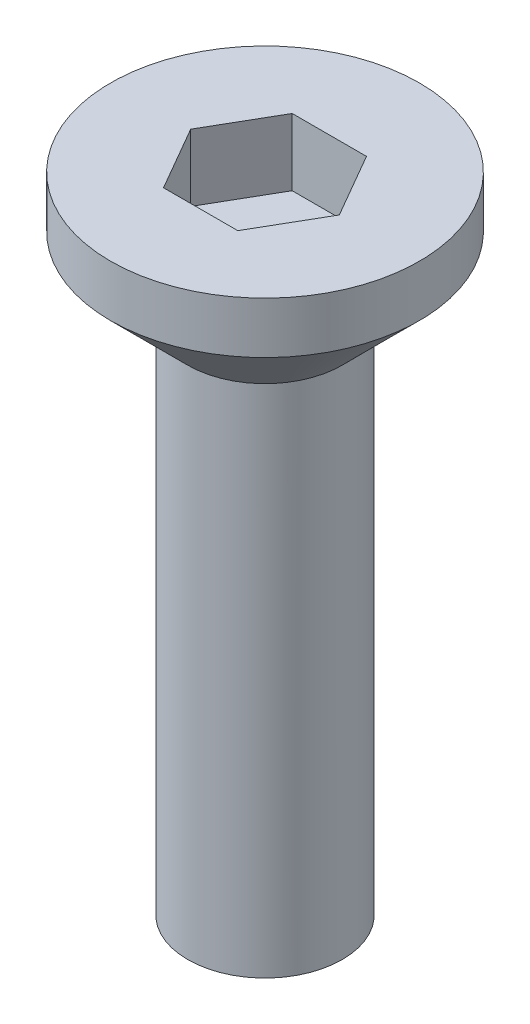
ISO-10303-21;
HEADER;
FILE_DESCRIPTION(('STEP AP214'),'2;1');
FILE_NAME('part.step','',(''),(''),'','','');
FILE_SCHEMA(('AUTOMOTIVE_DESIGN { 1 0 10303 214 1 1 1 1 }'));
ENDSEC;
DATA;
#1=APPLICATION_CONTEXT('core data for automotive mechanical design processes');
#2=APPLICATION_PROTOCOL_DEFINITION('international standard','automotive_design',2000,#1);
#3=PRODUCT_CONTEXT('',#1,'mechanical');
#4=PRODUCT('Part','Part','',(#3));
#5=PRODUCT_RELATED_PRODUCT_CATEGORY('part','',(#4));
#6=PRODUCT_DEFINITION_FORMATION('','',#4);
#7=PRODUCT_DEFINITION_CONTEXT('part definition',#1,'design');
#8=PRODUCT_DEFINITION('design','',#6,#7);
#9=PRODUCT_DEFINITION_SHAPE('','',#8);
#10=(LENGTH_UNIT() NAMED_UNIT(*) SI_UNIT(.MILLI.,.METRE.));
#11=(NAMED_UNIT(*) PLANE_ANGLE_UNIT() SI_UNIT($,.RADIAN.));
#12=(NAMED_UNIT(*) SI_UNIT($,.STERADIAN.) SOLID_ANGLE_UNIT());
#13=UNCERTAINTY_MEASURE_WITH_UNIT(LENGTH_MEASURE(1.E-05),#10,'distance_accuracy_value','');
#14=(GEOMETRIC_REPRESENTATION_CONTEXT(3) GLOBAL_UNCERTAINTY_ASSIGNED_CONTEXT((#13)) GLOBAL_UNIT_ASSIGNED_CONTEXT((#10,
#11,#12)) REPRESENTATION_CONTEXT('',''));
#15=CARTESIAN_POINT('',(0.,0.,0.));
#16=DIRECTION('',(0.,0.,1.));
#17=DIRECTION('',(1.,0.,0.));
#18=AXIS2_PLACEMENT_3D('',#15,#16,#17);
#19=CARTESIAN_POINT('',(0.,2.5,0.));
#20=DIRECTION('',(0.,-1.,0.));
#21=DIRECTION('',(0.,0.,-1.));
#22=AXIS2_PLACEMENT_3D('',#19,#20,#21);
#23=CYLINDRICAL_SURFACE('',#22,3.);
#24=CARTESIAN_POINT('',(0.,1.5,0.));
#25=DIRECTION('',(0.,1.,0.));
#26=DIRECTION('',(0.,0.,1.));
#27=AXIS2_PLACEMENT_3D('',#24,#25,#26);
#28=CIRCLE('',#27,3.);
#29=CARTESIAN_POINT('',(0.,1.5,3.));
#30=VERTEX_POINT('',#29);
#31=EDGE_CURVE('E45',#30,#30,#28,.T.);
#32=ORIENTED_EDGE('',*,*,#31,.T.);
#33=EDGE_LOOP('',(#32));
#34=FACE_BOUND('',#33,.T.);
#35=CARTESIAN_POINT('',(0.,2.5,0.));
#36=DIRECTION('',(0.,1.,0.));
#37=DIRECTION('',(0.,0.,1.));
#38=AXIS2_PLACEMENT_3D('',#35,#36,#37);
#39=CIRCLE('',#38,3.);
#40=CARTESIAN_POINT('',(0.,2.5,3.));
#41=VERTEX_POINT('',#40);
#42=EDGE_CURVE('E140',#41,#41,#39,.T.);
#43=ORIENTED_EDGE('',*,*,#42,.F.);
#44=EDGE_LOOP('',(#43));
#45=FACE_BOUND('',#44,.T.);
#46=ADVANCED_FACE('F37',(#34,#45),#23,.T.);
#47=CARTESIAN_POINT('',(0.,2.5,0.));
#48=DIRECTION('',(0.,1.,0.));
#49=DIRECTION('',(0.,0.,1.));
#50=AXIS2_PLACEMENT_3D('',#47,#48,#49);
#51=PLANE('',#50);
#52=DIRECTION('',(0.5,0.,-0.866025403784439));
#53=VECTOR('',#52,1.);
#54=CARTESIAN_POINT('',(0.721687836487032,2.5,1.25));
#55=LINE('',#54,#53);
#56=CARTESIAN_POINT('',(0.721687836487032,2.5,1.25));
#57=VERTEX_POINT('',#56);
#58=CARTESIAN_POINT('',(1.44337567297406,2.5,0.));
#59=VERTEX_POINT('',#58);
#60=EDGE_CURVE('E52',#57,#59,#55,.T.);
#61=ORIENTED_EDGE('',*,*,#60,.F.);
#62=DIRECTION('',(1.,0.,0.));
#63=VECTOR('',#62,1.);
#64=CARTESIAN_POINT('',(-0.721687836487033,2.5,1.25));
#65=LINE('',#64,#63);
#66=CARTESIAN_POINT('',(-0.721687836487033,2.5,1.25));
#67=VERTEX_POINT('',#66);
#68=EDGE_CURVE('E136',#67,#57,#65,.T.);
#69=ORIENTED_EDGE('',*,*,#68,.F.);
#70=DIRECTION('',(0.5,0.,0.866025403784439));
#71=VECTOR('',#70,1.);
#72=CARTESIAN_POINT('',(-1.44337567297407,2.5,0.));
#73=LINE('',#72,#71);
#74=CARTESIAN_POINT('',(-1.44337567297407,2.5,0.));
#75=VERTEX_POINT('',#74);
#76=EDGE_CURVE('E134',#75,#67,#73,.T.);
#77=ORIENTED_EDGE('',*,*,#76,.F.);
#78=DIRECTION('',(-0.5,0.,0.866025403784438));
#79=VECTOR('',#78,1.);
#80=CARTESIAN_POINT('',(-0.721687836487033,2.5,-1.25));
#81=LINE('',#80,#79);
#82=CARTESIAN_POINT('',(-0.721687836487033,2.5,-1.25));
#83=VERTEX_POINT('',#82);
#84=EDGE_CURVE('E100',#83,#75,#81,.T.);
#85=ORIENTED_EDGE('',*,*,#84,.F.);
#86=DIRECTION('',(-1.,0.,0.));
#87=VECTOR('',#86,1.);
#88=CARTESIAN_POINT('',(0.721687836487032,2.5,-1.25));
#89=LINE('',#88,#87);
#90=CARTESIAN_POINT('',(0.721687836487032,2.5,-1.25));
#91=VERTEX_POINT('',#90);
#92=EDGE_CURVE('E130',#91,#83,#89,.T.);
#93=ORIENTED_EDGE('',*,*,#92,.F.);
#94=DIRECTION('',(-0.5,0.,-0.866025403784439));
#95=VECTOR('',#94,1.);
#96=CARTESIAN_POINT('',(1.44337567297406,2.5,0.));
#97=LINE('',#96,#95);
#98=EDGE_CURVE('E126',#59,#91,#97,.T.);
#99=ORIENTED_EDGE('',*,*,#98,.F.);
#100=EDGE_LOOP('',(#61,#69,#77,#85,#93,#99));
#101=FACE_BOUND('',#100,.T.);
#102=ORIENTED_EDGE('',*,*,#42,.T.);
#103=EDGE_LOOP('',(#102));
#104=FACE_BOUND('',#103,.T.);
#105=ADVANCED_FACE('F154',(#101,#104),#51,.T.);
#106=CARTESIAN_POINT('',(0.,1.5,0.));
#107=DIRECTION('',(0.,1.,0.));
#108=DIRECTION('',(0.,0.,1.));
#109=AXIS2_PLACEMENT_3D('',#106,#107,#108);
#110=CONICAL_SURFACE('',#109,3.,0.78539816339745);
#111=CARTESIAN_POINT('',(0.,0.,0.));
#112=DIRECTION('',(0.,1.,0.));
#113=DIRECTION('',(0.,0.,1.));
#114=AXIS2_PLACEMENT_3D('',#111,#112,#113);
#115=CIRCLE('',#114,1.49999999999999);
#116=CARTESIAN_POINT('',(0.,0.,1.49999999999999));
#117=VERTEX_POINT('',#116);
#118=EDGE_CURVE('E11',#117,#117,#115,.F.);
#119=ORIENTED_EDGE('',*,*,#118,.F.);
#120=EDGE_LOOP('',(#119));
#121=FACE_BOUND('',#120,.T.);
#122=ORIENTED_EDGE('',*,*,#31,.F.);
#123=EDGE_LOOP('',(#122));
#124=FACE_BOUND('',#123,.T.);
#125=ADVANCED_FACE('F39',(#121,#124),#110,.T.);
#126=CARTESIAN_POINT('',(0.721687836487032,1.2,1.25));
#127=DIRECTION('',(0.866025403784439,0.,0.5));
#128=DIRECTION('',(0.5,0.,-0.866025403784439));
#129=AXIS2_PLACEMENT_3D('',#126,#127,#128);
#130=PLANE('',#129);
#131=ORIENTED_EDGE('',*,*,#60,.T.);
#132=DIRECTION('',(0.,1.,0.));
#133=VECTOR('',#132,1.);
#134=CARTESIAN_POINT('',(1.44337567297406,1.2,0.));
#135=LINE('',#134,#133);
#136=CARTESIAN_POINT('',(1.44337567297406,1.2,0.));
#137=VERTEX_POINT('',#136);
#138=EDGE_CURVE('E82',#137,#59,#135,.T.);
#139=ORIENTED_EDGE('',*,*,#138,.F.);
#140=DIRECTION('',(0.5,0.,-0.866025403784439));
#141=VECTOR('',#140,1.);
#142=CARTESIAN_POINT('',(0.721687836487032,1.2,1.25));
#143=LINE('',#142,#141);
#144=CARTESIAN_POINT('',(0.721687836487032,1.2,1.25));
#145=VERTEX_POINT('',#144);
#146=EDGE_CURVE('E138',#145,#137,#143,.T.);
#147=ORIENTED_EDGE('',*,*,#146,.F.);
#148=DIRECTION('',(0.,1.,0.));
#149=VECTOR('',#148,1.);
#150=CARTESIAN_POINT('',(0.721687836487032,1.2,1.25));
#151=LINE('',#150,#149);
#152=EDGE_CURVE('E60',#145,#57,#151,.T.);
#153=ORIENTED_EDGE('',*,*,#152,.T.);
#154=EDGE_LOOP('',(#131,#139,#147,#153));
#155=FACE_BOUND('',#154,.T.);
#156=ADVANCED_FACE('F153',(#155),#130,.F.);
#157=CARTESIAN_POINT('',(-0.721687836487033,1.2,1.25));
#158=DIRECTION('',(0.,0.,1.));
#159=DIRECTION('',(1.,0.,0.));
#160=AXIS2_PLACEMENT_3D('',#157,#158,#159);
#161=PLANE('',#160);
#162=ORIENTED_EDGE('',*,*,#68,.T.);
#163=ORIENTED_EDGE('',*,*,#152,.F.);
#164=DIRECTION('',(1.,0.,0.));
#165=VECTOR('',#164,1.);
#166=CARTESIAN_POINT('',(-0.721687836487033,1.2,1.25));
#167=LINE('',#166,#165);
#168=CARTESIAN_POINT('',(-0.721687836487033,1.2,1.25));
#169=VERTEX_POINT('',#168);
#170=EDGE_CURVE('E112',#169,#145,#167,.T.);
#171=ORIENTED_EDGE('',*,*,#170,.F.);
#172=DIRECTION('',(0.,1.,0.));
#173=VECTOR('',#172,1.);
#174=CARTESIAN_POINT('',(-0.721687836487033,1.2,1.25));
#175=LINE('',#174,#173);
#176=EDGE_CURVE('E104',#169,#67,#175,.T.);
#177=ORIENTED_EDGE('',*,*,#176,.T.);
#178=EDGE_LOOP('',(#162,#163,#171,#177));
#179=FACE_BOUND('',#178,.T.);
#180=ADVANCED_FACE('F160',(#179),#161,.F.);
#181=CARTESIAN_POINT('',(-1.44337567297407,1.2,0.));
#182=DIRECTION('',(-0.866025403784439,0.,0.5));
#183=DIRECTION('',(0.5,0.,0.866025403784439));
#184=AXIS2_PLACEMENT_3D('',#181,#182,#183);
#185=PLANE('',#184);
#186=ORIENTED_EDGE('',*,*,#76,.T.);
#187=ORIENTED_EDGE('',*,*,#176,.F.);
#188=DIRECTION('',(0.5,0.,0.866025403784439));
#189=VECTOR('',#188,1.);
#190=CARTESIAN_POINT('',(-1.44337567297407,1.2,0.));
#191=LINE('',#190,#189);
#192=CARTESIAN_POINT('',(-1.44337567297407,1.2,0.));
#193=VERTEX_POINT('',#192);
#194=EDGE_CURVE('E108',#193,#169,#191,.T.);
#195=ORIENTED_EDGE('',*,*,#194,.F.);
#196=DIRECTION('',(0.,1.,0.));
#197=VECTOR('',#196,1.);
#198=CARTESIAN_POINT('',(-1.44337567297407,1.2,0.));
#199=LINE('',#198,#197);
#200=EDGE_CURVE('E93',#193,#75,#199,.T.);
#201=ORIENTED_EDGE('',*,*,#200,.T.);
#202=EDGE_LOOP('',(#186,#187,#195,#201));
#203=FACE_BOUND('',#202,.T.);
#204=ADVANCED_FACE('F109',(#203),#185,.F.);
#205=CARTESIAN_POINT('',(-0.721687836487033,1.2,-1.25));
#206=DIRECTION('',(-0.866025403784439,0.,-0.5));
#207=DIRECTION('',(-0.5,0.,0.866025403784439));
#208=AXIS2_PLACEMENT_3D('',#205,#206,#207);
#209=PLANE('',#208);
#210=ORIENTED_EDGE('',*,*,#84,.T.);
#211=ORIENTED_EDGE('',*,*,#200,.F.);
#212=DIRECTION('',(-0.5,0.,0.866025403784438));
#213=VECTOR('',#212,1.);
#214=CARTESIAN_POINT('',(-0.721687836487033,1.2,-1.25));
#215=LINE('',#214,#213);
#216=CARTESIAN_POINT('',(-0.721687836487033,1.2,-1.25));
#217=VERTEX_POINT('',#216);
#218=EDGE_CURVE('E97',#217,#193,#215,.T.);
#219=ORIENTED_EDGE('',*,*,#218,.F.);
#220=DIRECTION('',(0.,1.,0.));
#221=VECTOR('',#220,1.);
#222=CARTESIAN_POINT('',(-0.721687836487033,1.2,-1.25));
#223=LINE('',#222,#221);
#224=EDGE_CURVE('E105',#217,#83,#223,.T.);
#225=ORIENTED_EDGE('',*,*,#224,.T.);
#226=EDGE_LOOP('',(#210,#211,#219,#225));
#227=FACE_BOUND('',#226,.T.);
#228=ADVANCED_FACE('F95',(#227),#209,.F.);
#229=CARTESIAN_POINT('',(0.721687836487032,1.2,-1.25));
#230=DIRECTION('',(0.,0.,-1.));
#231=DIRECTION('',(-1.,0.,0.));
#232=AXIS2_PLACEMENT_3D('',#229,#230,#231);
#233=PLANE('',#232);
#234=ORIENTED_EDGE('',*,*,#92,.T.);
#235=ORIENTED_EDGE('',*,*,#224,.F.);
#236=DIRECTION('',(-1.,0.,0.));
#237=VECTOR('',#236,1.);
#238=CARTESIAN_POINT('',(0.721687836487032,1.2,-1.25));
#239=LINE('',#238,#237);
#240=CARTESIAN_POINT('',(0.721687836487032,1.2,-1.25));
#241=VERTEX_POINT('',#240);
#242=EDGE_CURVE('E118',#241,#217,#239,.T.);
#243=ORIENTED_EDGE('',*,*,#242,.F.);
#244=DIRECTION('',(0.,1.,0.));
#245=VECTOR('',#244,1.);
#246=CARTESIAN_POINT('',(0.721687836487032,1.2,-1.25));
#247=LINE('',#246,#245);
#248=EDGE_CURVE('E143',#241,#91,#247,.T.);
#249=ORIENTED_EDGE('',*,*,#248,.T.);
#250=EDGE_LOOP('',(#234,#235,#243,#249));
#251=FACE_BOUND('',#250,.T.);
#252=ADVANCED_FACE('F172',(#251),#233,.F.);
#253=CARTESIAN_POINT('',(1.44337567297406,1.2,0.));
#254=DIRECTION('',(0.866025403784439,0.,-0.5));
#255=DIRECTION('',(-0.5,0.,-0.866025403784439));
#256=AXIS2_PLACEMENT_3D('',#253,#254,#255);
#257=PLANE('',#256);
#258=ORIENTED_EDGE('',*,*,#98,.T.);
#259=ORIENTED_EDGE('',*,*,#248,.F.);
#260=DIRECTION('',(-0.5,0.,-0.866025403784439));
#261=VECTOR('',#260,1.);
#262=CARTESIAN_POINT('',(1.44337567297406,1.2,0.));
#263=LINE('',#262,#261);
#264=EDGE_CURVE('E120',#137,#241,#263,.T.);
#265=ORIENTED_EDGE('',*,*,#264,.F.);
#266=ORIENTED_EDGE('',*,*,#138,.T.);
#267=EDGE_LOOP('',(#258,#259,#265,#266));
#268=FACE_BOUND('',#267,.T.);
#269=ADVANCED_FACE('F169',(#268),#257,.F.);
#270=CARTESIAN_POINT('',(0.,1.2,0.));
#271=DIRECTION('',(0.,1.,0.));
#272=DIRECTION('',(0.,0.,1.));
#273=AXIS2_PLACEMENT_3D('',#270,#271,#272);
#274=PLANE('',#273);
#275=ORIENTED_EDGE('',*,*,#146,.T.);
#276=ORIENTED_EDGE('',*,*,#264,.T.);
#277=ORIENTED_EDGE('',*,*,#242,.T.);
#278=ORIENTED_EDGE('',*,*,#218,.T.);
#279=ORIENTED_EDGE('',*,*,#194,.T.);
#280=ORIENTED_EDGE('',*,*,#170,.T.);
#281=EDGE_LOOP('',(#275,#276,#277,#278,#279,#280));
#282=FACE_BOUND('',#281,.T.);
#283=ADVANCED_FACE('F115',(#282),#274,.T.);
#284=CARTESIAN_POINT('',(0.,-10.,0.));
#285=DIRECTION('',(0.,1.,0.));
#286=DIRECTION('',(0.,0.,1.));
#287=AXIS2_PLACEMENT_3D('',#284,#285,#286);
#288=CYLINDRICAL_SURFACE('',#287,1.5);
#289=CARTESIAN_POINT('',(0.,-10.,0.));
#290=DIRECTION('',(0.,-1.,0.));
#291=DIRECTION('',(0.,0.,-1.));
#292=AXIS2_PLACEMENT_3D('',#289,#290,#291);
#293=CIRCLE('',#292,1.5);
#294=CARTESIAN_POINT('',(0.,-10.,-1.5));
#295=VERTEX_POINT('',#294);
#296=EDGE_CURVE('E127',#295,#295,#293,.T.);
#297=ORIENTED_EDGE('',*,*,#296,.F.);
#298=EDGE_LOOP('',(#297));
#299=FACE_BOUND('',#298,.T.);
#300=ORIENTED_EDGE('',*,*,#118,.T.);
#301=EDGE_LOOP('',(#300));
#302=FACE_BOUND('',#301,.T.);
#303=ADVANCED_FACE('F185',(#299,#302),#288,.T.);
#304=CARTESIAN_POINT('',(0.,-10.,0.));
#305=DIRECTION('',(0.,-1.,0.));
#306=DIRECTION('',(0.,0.,-1.));
#307=AXIS2_PLACEMENT_3D('',#304,#305,#306);
#308=PLANE('',#307);
#309=ORIENTED_EDGE('',*,*,#296,.T.);
#310=EDGE_LOOP('',(#309));
#311=FACE_BOUND('',#310,.T.);
#312=ADVANCED_FACE('F188',(#311),#308,.T.);
#313=CLOSED_SHELL('',(#46,#105,#125,#156,#180,#204,#228,#252,#269,#283,#303,#312));
#314=MANIFOLD_SOLID_BREP('B2',#313);
#315=ADVANCED_BREP_SHAPE_REPRESENTATION('',(#18,#314),#14);
#316=SHAPE_DEFINITION_REPRESENTATION(#9,#315);
ENDSEC;
END-ISO-10303-21;
